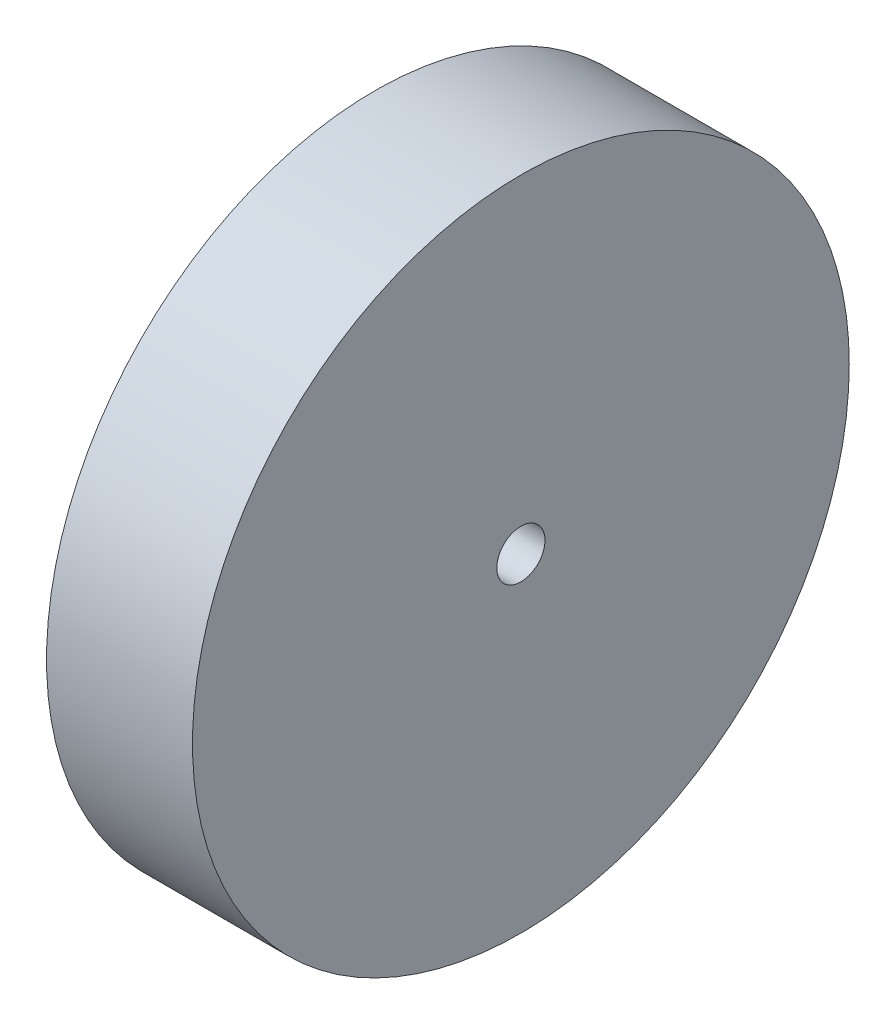
ISO-10303-21;
HEADER;
FILE_DESCRIPTION(('STEP AP214'),'2;1');
FILE_NAME('part.step','',(''),(''),'','','');
FILE_SCHEMA(('AUTOMOTIVE_DESIGN { 1 0 10303 214 1 1 1 1 }'));
ENDSEC;
DATA;
#1=APPLICATION_CONTEXT('core data for automotive mechanical design processes');
#2=APPLICATION_PROTOCOL_DEFINITION('international standard','automotive_design',2000,#1);
#3=PRODUCT_CONTEXT('',#1,'mechanical');
#4=PRODUCT('Part','Part','',(#3));
#5=PRODUCT_RELATED_PRODUCT_CATEGORY('part','',(#4));
#6=PRODUCT_DEFINITION_FORMATION('','',#4);
#7=PRODUCT_DEFINITION_CONTEXT('part definition',#1,'design');
#8=PRODUCT_DEFINITION('design','',#6,#7);
#9=PRODUCT_DEFINITION_SHAPE('','',#8);
#10=(LENGTH_UNIT() NAMED_UNIT(*) SI_UNIT(.MILLI.,.METRE.));
#11=(NAMED_UNIT(*) PLANE_ANGLE_UNIT() SI_UNIT($,.RADIAN.));
#12=(NAMED_UNIT(*) SI_UNIT($,.STERADIAN.) SOLID_ANGLE_UNIT());
#13=UNCERTAINTY_MEASURE_WITH_UNIT(LENGTH_MEASURE(1.E-05),#10,'distance_accuracy_value','');
#14=(GEOMETRIC_REPRESENTATION_CONTEXT(3) GLOBAL_UNCERTAINTY_ASSIGNED_CONTEXT((#13)) GLOBAL_UNIT_ASSIGNED_CONTEXT((#10,
#11,#12)) REPRESENTATION_CONTEXT('',''));
#15=CARTESIAN_POINT('',(0.,0.,0.));
#16=DIRECTION('',(0.,0.,1.));
#17=DIRECTION('',(1.,0.,0.));
#18=AXIS2_PLACEMENT_3D('',#15,#16,#17);
#19=CARTESIAN_POINT('',(16.9333333333333,0.,0.));
#20=DIRECTION('',(-1.,0.,0.));
#21=DIRECTION('',(0.,0.,1.));
#22=AXIS2_PLACEMENT_3D('',#19,#20,#21);
#23=CYLINDRICAL_SURFACE('',#22,38.1);
#24=CARTESIAN_POINT('',(16.9333333333333,0.,0.));
#25=DIRECTION('',(1.,0.,0.));
#26=DIRECTION('',(0.,0.,-1.));
#27=AXIS2_PLACEMENT_3D('',#24,#25,#26);
#28=CIRCLE('',#27,38.1);
#29=CARTESIAN_POINT('',(16.9333333333333,0.,-38.1));
#30=VERTEX_POINT('',#29);
#31=EDGE_CURVE('E10',#30,#30,#28,.T.);
#32=ORIENTED_EDGE('',*,*,#31,.F.);
#33=EDGE_LOOP('',(#32));
#34=FACE_BOUND('',#33,.T.);
#35=CARTESIAN_POINT('',(0.,0.,0.));
#36=DIRECTION('',(1.,0.,0.));
#37=DIRECTION('',(0.,0.,-1.));
#38=AXIS2_PLACEMENT_3D('',#35,#36,#37);
#39=CIRCLE('',#38,38.1);
#40=CARTESIAN_POINT('',(0.,0.,-38.1));
#41=VERTEX_POINT('',#40);
#42=EDGE_CURVE('E35',#41,#41,#39,.T.);
#43=ORIENTED_EDGE('',*,*,#42,.T.);
#44=EDGE_LOOP('',(#43));
#45=FACE_BOUND('',#44,.T.);
#46=ADVANCED_FACE('F32',(#34,#45),#23,.T.);
#47=CARTESIAN_POINT('',(16.9333333333333,0.,0.));
#48=DIRECTION('',(1.,0.,0.));
#49=DIRECTION('',(0.,0.,-1.));
#50=AXIS2_PLACEMENT_3D('',#47,#48,#49);
#51=PLANE('',#50);
#52=CARTESIAN_POINT('',(16.9333333333333,0.,0.));
#53=DIRECTION('',(1.,0.,0.));
#54=DIRECTION('',(0.,0.,-1.));
#55=AXIS2_PLACEMENT_3D('',#52,#53,#54);
#56=CIRCLE('',#55,2.794);
#57=CARTESIAN_POINT('',(16.9333333333333,0.,-2.794));
#58=VERTEX_POINT('',#57);
#59=EDGE_CURVE('E44',#58,#58,#56,.T.);
#60=ORIENTED_EDGE('',*,*,#59,.F.);
#61=EDGE_LOOP('',(#60));
#62=FACE_BOUND('',#61,.T.);
#63=ORIENTED_EDGE('',*,*,#31,.T.);
#64=EDGE_LOOP('',(#63));
#65=FACE_BOUND('',#64,.T.);
#66=ADVANCED_FACE('F59',(#62,#65),#51,.T.);
#67=CARTESIAN_POINT('',(0.,0.,0.));
#68=DIRECTION('',(1.,0.,0.));
#69=DIRECTION('',(0.,0.,-1.));
#70=AXIS2_PLACEMENT_3D('',#67,#68,#69);
#71=PLANE('',#70);
#72=CARTESIAN_POINT('',(0.,0.,0.));
#73=DIRECTION('',(1.,0.,0.));
#74=DIRECTION('',(0.,0.,-1.));
#75=AXIS2_PLACEMENT_3D('',#72,#73,#74);
#76=CIRCLE('',#75,2.794);
#77=CARTESIAN_POINT('',(0.,0.,-2.794));
#78=VERTEX_POINT('',#77);
#79=EDGE_CURVE('E42',#78,#78,#76,.T.);
#80=ORIENTED_EDGE('',*,*,#79,.T.);
#81=EDGE_LOOP('',(#80));
#82=FACE_BOUND('',#81,.T.);
#83=ORIENTED_EDGE('',*,*,#42,.F.);
#84=EDGE_LOOP('',(#83));
#85=FACE_BOUND('',#84,.T.);
#86=ADVANCED_FACE('F50',(#82,#85),#71,.F.);
#87=CARTESIAN_POINT('',(0.,0.,0.));
#88=DIRECTION('',(1.,0.,0.));
#89=DIRECTION('',(0.,0.,-1.));
#90=AXIS2_PLACEMENT_3D('',#87,#88,#89);
#91=CYLINDRICAL_SURFACE('',#90,2.794);
#92=ORIENTED_EDGE('',*,*,#79,.F.);
#93=EDGE_LOOP('',(#92));
#94=FACE_BOUND('',#93,.T.);
#95=ORIENTED_EDGE('',*,*,#59,.T.);
#96=EDGE_LOOP('',(#95));
#97=FACE_BOUND('',#96,.T.);
#98=ADVANCED_FACE('F53',(#94,#97),#91,.F.);
#99=CLOSED_SHELL('',(#46,#66,#86,#98));
#100=MANIFOLD_SOLID_BREP('B2',#99);
#101=ADVANCED_BREP_SHAPE_REPRESENTATION('',(#18,#100),#14);
#102=SHAPE_DEFINITION_REPRESENTATION(#9,#101);
ENDSEC;
END-ISO-10303-21;
